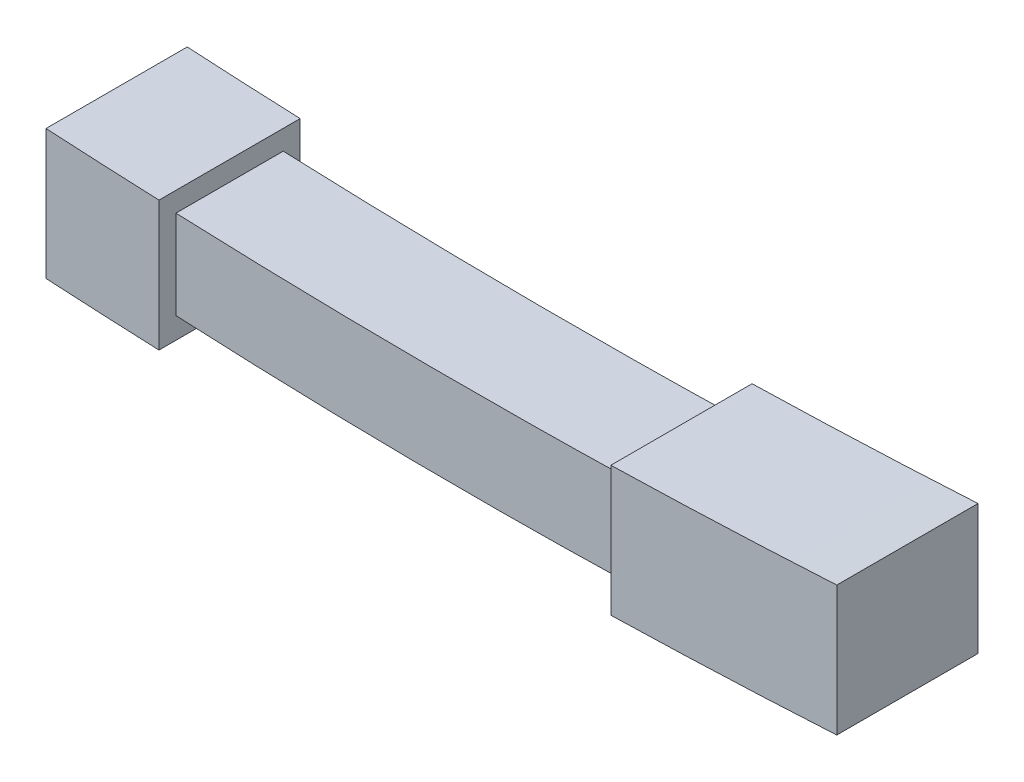
ISO-10303-21;
HEADER;
FILE_DESCRIPTION(('STEP AP214'),'2;1');
FILE_NAME('part.step','',(''),(''),'','','');
FILE_SCHEMA(('AUTOMOTIVE_DESIGN { 1 0 10303 214 1 1 1 1 }'));
ENDSEC;
DATA;
#1=APPLICATION_CONTEXT('core data for automotive mechanical design processes');
#2=APPLICATION_PROTOCOL_DEFINITION('international standard','automotive_design',2000,#1);
#3=PRODUCT_CONTEXT('',#1,'mechanical');
#4=PRODUCT('Part','Part','',(#3));
#5=PRODUCT_RELATED_PRODUCT_CATEGORY('part','',(#4));
#6=PRODUCT_DEFINITION_FORMATION('','',#4);
#7=PRODUCT_DEFINITION_CONTEXT('part definition',#1,'design');
#8=PRODUCT_DEFINITION('design','',#6,#7);
#9=PRODUCT_DEFINITION_SHAPE('','',#8);
#10=(LENGTH_UNIT() NAMED_UNIT(*) SI_UNIT(.MILLI.,.METRE.));
#11=(NAMED_UNIT(*) PLANE_ANGLE_UNIT() SI_UNIT($,.RADIAN.));
#12=(NAMED_UNIT(*) SI_UNIT($,.STERADIAN.) SOLID_ANGLE_UNIT());
#13=UNCERTAINTY_MEASURE_WITH_UNIT(LENGTH_MEASURE(1.E-05),#10,'distance_accuracy_value','');
#14=(GEOMETRIC_REPRESENTATION_CONTEXT(3) GLOBAL_UNCERTAINTY_ASSIGNED_CONTEXT((#13)) GLOBAL_UNIT_ASSIGNED_CONTEXT((#10,
#11,#12)) REPRESENTATION_CONTEXT('',''));
#15=CARTESIAN_POINT('',(0.,0.,0.));
#16=DIRECTION('',(0.,0.,1.));
#17=DIRECTION('',(1.,0.,0.));
#18=AXIS2_PLACEMENT_3D('',#15,#16,#17);
#19=CARTESIAN_POINT('',(-50.,20.5204081632653,-12.5));
#20=CARTESIAN_POINT('',(-10.0053296914234,18.8877550966062,-12.5));
#21=CARTESIAN_POINT('',(30.,19.8673469387755,-12.5));
#22=B_SPLINE_CURVE_WITH_KNOTS('',2,(#19,#20,#21),.UNSPECIFIED.,.F.,.F.,(3,3),(0.,1.),.UNSPECIFIED.);
#23=DIRECTION('',(0.,0.,1.));
#24=VECTOR('',#23,1.);
#25=SURFACE_OF_LINEAR_EXTRUSION('',#22,#24);
#26=CARTESIAN_POINT('',(-50.,20.5204081632653,-9.50000000000003));
#27=CARTESIAN_POINT('',(-10.0053296914234,18.8877550966062,-9.50000000000003));
#28=CARTESIAN_POINT('',(30.,19.8673469387755,-9.50000000000003));
#29=B_SPLINE_CURVE_WITH_KNOTS('',2,(#26,#27,#28),.UNSPECIFIED.,.F.,.F.,(3,3),(0.,1.),.UNSPECIFIED.);
#30=CARTESIAN_POINT('',(-50.,20.5204081632653,-9.50000000000002));
#31=VERTEX_POINT('',#30);
#32=CARTESIAN_POINT('',(30.,19.8673469387755,-9.50000000000004));
#33=VERTEX_POINT('',#32);
#34=EDGE_CURVE('E127',#31,#33,#29,.T.);
#35=ORIENTED_EDGE('',*,*,#34,.F.);
#36=DIRECTION('',(0.,0.,1.));
#37=VECTOR('',#36,1.);
#38=CARTESIAN_POINT('',(-50.,20.5204081632653,-12.5));
#39=LINE('',#38,#37);
#40=CARTESIAN_POINT('',(-50.,20.5204081632653,9.50000000000001));
#41=VERTEX_POINT('',#40);
#42=EDGE_CURVE('E152',#31,#41,#39,.T.);
#43=ORIENTED_EDGE('',*,*,#42,.T.);
#44=CARTESIAN_POINT('',(-50.,20.5204081632653,9.5));
#45=CARTESIAN_POINT('',(-10.0053296914234,18.8877550966062,9.5));
#46=CARTESIAN_POINT('',(30.,19.8673469387755,9.5));
#47=B_SPLINE_CURVE_WITH_KNOTS('',2,(#44,#45,#46),.UNSPECIFIED.,.F.,.F.,(3,3),(0.,1.),.UNSPECIFIED.);
#48=CARTESIAN_POINT('',(30.,19.8673469387755,9.50000000000001));
#49=VERTEX_POINT('',#48);
#50=EDGE_CURVE('E150',#49,#41,#47,.F.);
#51=ORIENTED_EDGE('',*,*,#50,.F.);
#52=DIRECTION('',(0.,0.,1.));
#53=VECTOR('',#52,1.);
#54=CARTESIAN_POINT('',(30.,19.8673469387755,-12.5));
#55=LINE('',#54,#53);
#56=EDGE_CURVE('E144',#33,#49,#55,.T.);
#57=ORIENTED_EDGE('',*,*,#56,.F.);
#58=EDGE_LOOP('',(#35,#43,#51,#57));
#59=FACE_BOUND('',#58,.T.);
#60=ADVANCED_FACE('F35',(#59),#25,.F.);
#61=CARTESIAN_POINT('',(-50.,4.81303337381789,-12.5));
#62=CARTESIAN_POINT('',(-10.0107895376873,2.79999119229216,-12.5));
#63=CARTESIAN_POINT('',(30.,3.86734693877551,-12.5));
#64=B_SPLINE_CURVE_WITH_KNOTS('',2,(#61,#62,#63),.UNSPECIFIED.,.F.,.F.,(3,3),(0.,1.),.UNSPECIFIED.);
#65=DIRECTION('',(0.,0.,1.));
#66=VECTOR('',#65,1.);
#67=SURFACE_OF_LINEAR_EXTRUSION('',#64,#66);
#68=DIRECTION('',(0.,0.,1.));
#69=VECTOR('',#68,1.);
#70=CARTESIAN_POINT('',(-50.,4.81303337381789,-12.5));
#71=LINE('',#70,#69);
#72=CARTESIAN_POINT('',(-50.,4.81303337381789,-9.50000000000002));
#73=VERTEX_POINT('',#72);
#74=CARTESIAN_POINT('',(-50.,4.81303337381789,9.5));
#75=VERTEX_POINT('',#74);
#76=EDGE_CURVE('E50',#73,#75,#71,.T.);
#77=ORIENTED_EDGE('',*,*,#76,.F.);
#78=CARTESIAN_POINT('',(-50.,4.81303337381789,-9.50000000000003));
#79=CARTESIAN_POINT('',(-10.0107895376873,2.79999119229216,-9.50000000000003));
#80=CARTESIAN_POINT('',(30.,3.86734693877551,-9.50000000000003));
#81=B_SPLINE_CURVE_WITH_KNOTS('',2,(#78,#79,#80),.UNSPECIFIED.,.F.,.F.,(3,3),(0.,1.),.UNSPECIFIED.);
#82=CARTESIAN_POINT('',(30.,3.86734693877552,-9.50000000000004));
#83=VERTEX_POINT('',#82);
#84=EDGE_CURVE('E137',#73,#83,#81,.T.);
#85=ORIENTED_EDGE('',*,*,#84,.T.);
#86=DIRECTION('',(0.,0.,1.));
#87=VECTOR('',#86,1.);
#88=CARTESIAN_POINT('',(30.,3.86734693877551,-12.5));
#89=LINE('',#88,#87);
#90=CARTESIAN_POINT('',(30.,3.86734693877551,9.50000000000001));
#91=VERTEX_POINT('',#90);
#92=EDGE_CURVE('E146',#83,#91,#89,.T.);
#93=ORIENTED_EDGE('',*,*,#92,.T.);
#94=CARTESIAN_POINT('',(-50.,4.81303337381789,9.5));
#95=CARTESIAN_POINT('',(-10.0107895376873,2.79999119229216,9.5));
#96=CARTESIAN_POINT('',(30.,3.86734693877551,9.5));
#97=B_SPLINE_CURVE_WITH_KNOTS('',2,(#94,#95,#96),.UNSPECIFIED.,.F.,.F.,(3,3),(0.,1.),.UNSPECIFIED.);
#98=EDGE_CURVE('E496',#91,#75,#97,.F.);
#99=ORIENTED_EDGE('',*,*,#98,.T.);
#100=EDGE_LOOP('',(#77,#85,#93,#99));
#101=FACE_BOUND('',#100,.T.);
#102=ADVANCED_FACE('F251',(#101),#67,.T.);
#103=CARTESIAN_POINT('',(70.,25.,-12.5));
#104=DIRECTION('',(0.,0.,1.));
#105=DIRECTION('',(1.,0.,0.));
#106=AXIS2_PLACEMENT_3D('',#103,#104,#105);
#107=PLANE('',#106);
#108=CARTESIAN_POINT('',(-70.,2.,-12.5));
#109=CARTESIAN_POINT('',(0.,-2.,-12.5));
#110=CARTESIAN_POINT('',(70.,2.,-12.5));
#111=B_SPLINE_CURVE_WITH_KNOTS('',2,(#108,#109,#110),.UNSPECIFIED.,.F.,.F.,(3,3),(0.,1.),.UNSPECIFIED.);
#112=CARTESIAN_POINT('',(30.,0.36734693877551,-12.5));
#113=VERTEX_POINT('',#112);
#114=CARTESIAN_POINT('',(70.,2.,-12.5));
#115=VERTEX_POINT('',#114);
#116=EDGE_CURVE('E194',#113,#115,#111,.T.);
#117=ORIENTED_EDGE('',*,*,#116,.F.);
#118=DIRECTION('',(0.,-1.,0.));
#119=VECTOR('',#118,1.);
#120=CARTESIAN_POINT('',(30.,0.,-12.5));
#121=LINE('',#120,#119);
#122=CARTESIAN_POINT('',(30.,23.3673469387755,-12.5));
#123=VERTEX_POINT('',#122);
#124=EDGE_CURVE('E266',#123,#113,#121,.T.);
#125=ORIENTED_EDGE('',*,*,#124,.F.);
#126=CARTESIAN_POINT('',(-70.,25.,-12.5));
#127=CARTESIAN_POINT('',(0.,21.,-12.5));
#128=CARTESIAN_POINT('',(70.,25.,-12.5));
#129=B_SPLINE_CURVE_WITH_KNOTS('',2,(#126,#127,#128),.UNSPECIFIED.,.F.,.F.,(3,3),(0.,1.),.UNSPECIFIED.);
#130=CARTESIAN_POINT('',(70.,25.,-12.5));
#131=VERTEX_POINT('',#130);
#132=EDGE_CURVE('E161',#123,#131,#129,.T.);
#133=ORIENTED_EDGE('',*,*,#132,.T.);
#134=DIRECTION('',(0.,-1.,0.));
#135=VECTOR('',#134,1.);
#136=CARTESIAN_POINT('',(70.,25.,-12.5));
#137=LINE('',#136,#135);
#138=EDGE_CURVE('E168',#131,#115,#137,.T.);
#139=ORIENTED_EDGE('',*,*,#138,.T.);
#140=EDGE_LOOP('',(#117,#125,#133,#139));
#141=FACE_BOUND('',#140,.T.);
#142=ADVANCED_FACE('F241',(#141),#107,.F.);
#143=CARTESIAN_POINT('',(70.,25.,12.5));
#144=DIRECTION('',(0.,0.,-1.));
#145=DIRECTION('',(-1.,0.,0.));
#146=AXIS2_PLACEMENT_3D('',#143,#144,#145);
#147=PLANE('',#146);
#148=CARTESIAN_POINT('',(-70.,2.,12.5));
#149=CARTESIAN_POINT('',(0.,-2.,12.5));
#150=CARTESIAN_POINT('',(70.,2.,12.5));
#151=B_SPLINE_CURVE_WITH_KNOTS('',2,(#148,#149,#150),.UNSPECIFIED.,.F.,.F.,(3,3),(0.,1.),.UNSPECIFIED.);
#152=CARTESIAN_POINT('',(-70.,2.,12.5));
#153=VERTEX_POINT('',#152);
#154=CARTESIAN_POINT('',(-50.,1.02040816326531,12.5));
#155=VERTEX_POINT('',#154);
#156=EDGE_CURVE('E191',#153,#155,#151,.T.);
#157=ORIENTED_EDGE('',*,*,#156,.T.);
#158=DIRECTION('',(0.,-1.,0.));
#159=VECTOR('',#158,1.);
#160=CARTESIAN_POINT('',(-50.,0.,12.5));
#161=LINE('',#160,#159);
#162=CARTESIAN_POINT('',(-50.,24.0204081632653,12.5));
#163=VERTEX_POINT('',#162);
#164=EDGE_CURVE('E482',#163,#155,#161,.T.);
#165=ORIENTED_EDGE('',*,*,#164,.F.);
#166=CARTESIAN_POINT('',(-70.,25.,12.5));
#167=CARTESIAN_POINT('',(0.,21.,12.5));
#168=CARTESIAN_POINT('',(70.,25.,12.5));
#169=B_SPLINE_CURVE_WITH_KNOTS('',2,(#166,#167,#168),.UNSPECIFIED.,.F.,.F.,(3,3),(0.,1.),.UNSPECIFIED.);
#170=CARTESIAN_POINT('',(-70.,25.,12.5));
#171=VERTEX_POINT('',#170);
#172=EDGE_CURVE('E208',#171,#163,#169,.T.);
#173=ORIENTED_EDGE('',*,*,#172,.F.);
#174=DIRECTION('',(0.,-1.,0.));
#175=VECTOR('',#174,1.);
#176=CARTESIAN_POINT('',(-70.,25.,12.5));
#177=LINE('',#176,#175);
#178=EDGE_CURVE('E11',#171,#153,#177,.T.);
#179=ORIENTED_EDGE('',*,*,#178,.T.);
#180=EDGE_LOOP('',(#157,#165,#173,#179));
#181=FACE_BOUND('',#180,.T.);
#182=ADVANCED_FACE('F243',(#181),#147,.F.);
#183=DIRECTION('',(0.,-1.,0.));
#184=VECTOR('',#183,1.);
#185=CARTESIAN_POINT('',(30.,0.,12.5));
#186=LINE('',#185,#184);
#187=CARTESIAN_POINT('',(30.,23.3673469387755,12.5));
#188=VERTEX_POINT('',#187);
#189=CARTESIAN_POINT('',(30.,0.36734693877551,12.5));
#190=VERTEX_POINT('',#189);
#191=EDGE_CURVE('E186',#188,#190,#186,.T.);
#192=ORIENTED_EDGE('',*,*,#191,.T.);
#193=CARTESIAN_POINT('',(-70.,2.,12.5));
#194=CARTESIAN_POINT('',(0.,-2.,12.5));
#195=CARTESIAN_POINT('',(70.,2.,12.5));
#196=B_SPLINE_CURVE_WITH_KNOTS('',2,(#193,#194,#195),.UNSPECIFIED.,.F.,.F.,(3,3),(0.,1.),.UNSPECIFIED.);
#197=CARTESIAN_POINT('',(70.,2.,12.5));
#198=VERTEX_POINT('',#197);
#199=EDGE_CURVE('E184',#190,#198,#196,.T.);
#200=ORIENTED_EDGE('',*,*,#199,.T.);
#201=DIRECTION('',(0.,-1.,0.));
#202=VECTOR('',#201,1.);
#203=CARTESIAN_POINT('',(70.,25.,12.5));
#204=LINE('',#203,#202);
#205=CARTESIAN_POINT('',(70.,25.,12.5));
#206=VERTEX_POINT('',#205);
#207=EDGE_CURVE('E43',#206,#198,#204,.T.);
#208=ORIENTED_EDGE('',*,*,#207,.F.);
#209=CARTESIAN_POINT('',(-70.,25.,12.5));
#210=CARTESIAN_POINT('',(0.,21.,12.5));
#211=CARTESIAN_POINT('',(70.,25.,12.5));
#212=B_SPLINE_CURVE_WITH_KNOTS('',2,(#209,#210,#211),.UNSPECIFIED.,.F.,.F.,(3,3),(0.,1.),.UNSPECIFIED.);
#213=EDGE_CURVE('E182',#188,#206,#212,.T.);
#214=ORIENTED_EDGE('',*,*,#213,.F.);
#215=EDGE_LOOP('',(#192,#200,#208,#214));
#216=FACE_BOUND('',#215,.T.);
#217=ADVANCED_FACE('F181',(#216),#147,.F.);
#218=CARTESIAN_POINT('',(-70.,25.,12.5));
#219=DIRECTION('',(1.,0.,0.));
#220=DIRECTION('',(0.,0.,-1.));
#221=AXIS2_PLACEMENT_3D('',#218,#219,#220);
#222=PLANE('',#221);
#223=DIRECTION('',(0.,0.,1.));
#224=VECTOR('',#223,1.);
#225=CARTESIAN_POINT('',(-70.,2.,-12.5));
#226=LINE('',#225,#224);
#227=CARTESIAN_POINT('',(-70.,2.,-12.5));
#228=VERTEX_POINT('',#227);
#229=EDGE_CURVE('E212',#228,#153,#226,.T.);
#230=ORIENTED_EDGE('',*,*,#229,.T.);
#231=ORIENTED_EDGE('',*,*,#178,.F.);
#232=DIRECTION('',(0.,0.,1.));
#233=VECTOR('',#232,1.);
#234=CARTESIAN_POINT('',(-70.,25.,12.5));
#235=LINE('',#234,#233);
#236=CARTESIAN_POINT('',(-70.,25.,-12.5));
#237=VERTEX_POINT('',#236);
#238=EDGE_CURVE('E154',#237,#171,#235,.T.);
#239=ORIENTED_EDGE('',*,*,#238,.F.);
#240=DIRECTION('',(0.,-1.,0.));
#241=VECTOR('',#240,1.);
#242=CARTESIAN_POINT('',(-70.,25.,-12.5));
#243=LINE('',#242,#241);
#244=EDGE_CURVE('E165',#237,#228,#243,.T.);
#245=ORIENTED_EDGE('',*,*,#244,.T.);
#246=EDGE_LOOP('',(#230,#231,#239,#245));
#247=FACE_BOUND('',#246,.T.);
#248=ADVANCED_FACE('F37',(#247),#222,.F.);
#249=CARTESIAN_POINT('',(70.,25.,12.5));
#250=DIRECTION('',(-1.,0.,0.));
#251=DIRECTION('',(0.,0.,1.));
#252=AXIS2_PLACEMENT_3D('',#249,#250,#251);
#253=PLANE('',#252);
#254=DIRECTION('',(0.,0.,1.));
#255=VECTOR('',#254,1.);
#256=CARTESIAN_POINT('',(70.,2.,-12.5));
#257=LINE('',#256,#255);
#258=EDGE_CURVE('E177',#115,#198,#257,.T.);
#259=ORIENTED_EDGE('',*,*,#258,.F.);
#260=ORIENTED_EDGE('',*,*,#138,.F.);
#261=DIRECTION('',(0.,0.,-1.));
#262=VECTOR('',#261,1.);
#263=CARTESIAN_POINT('',(70.,25.,12.5));
#264=LINE('',#263,#262);
#265=EDGE_CURVE('E163',#206,#131,#264,.T.);
#266=ORIENTED_EDGE('',*,*,#265,.F.);
#267=ORIENTED_EDGE('',*,*,#207,.T.);
#268=EDGE_LOOP('',(#259,#260,#266,#267));
#269=FACE_BOUND('',#268,.T.);
#270=ADVANCED_FACE('F175',(#269),#253,.F.);
#271=DIRECTION('',(0.,-1.,0.));
#272=VECTOR('',#271,1.);
#273=CARTESIAN_POINT('',(-50.,0.,-12.5));
#274=LINE('',#273,#272);
#275=CARTESIAN_POINT('',(-50.,24.0204081632653,-12.5));
#276=VERTEX_POINT('',#275);
#277=CARTESIAN_POINT('',(-50.,1.0204081632653,-12.5));
#278=VERTEX_POINT('',#277);
#279=EDGE_CURVE('E58',#276,#278,#274,.T.);
#280=ORIENTED_EDGE('',*,*,#279,.T.);
#281=CARTESIAN_POINT('',(-70.,2.,-12.5));
#282=CARTESIAN_POINT('',(0.,-2.,-12.5));
#283=CARTESIAN_POINT('',(70.,2.,-12.5));
#284=B_SPLINE_CURVE_WITH_KNOTS('',2,(#281,#282,#283),.UNSPECIFIED.,.F.,.F.,(3,3),(0.,1.),.UNSPECIFIED.);
#285=EDGE_CURVE('E190',#228,#278,#284,.T.);
#286=ORIENTED_EDGE('',*,*,#285,.F.);
#287=ORIENTED_EDGE('',*,*,#244,.F.);
#288=CARTESIAN_POINT('',(-70.,25.,-12.5));
#289=CARTESIAN_POINT('',(0.,21.,-12.5));
#290=CARTESIAN_POINT('',(70.,25.,-12.5));
#291=B_SPLINE_CURVE_WITH_KNOTS('',2,(#288,#289,#290),.UNSPECIFIED.,.F.,.F.,(3,3),(0.,1.),.UNSPECIFIED.);
#292=EDGE_CURVE('E219',#237,#276,#291,.T.);
#293=ORIENTED_EDGE('',*,*,#292,.T.);
#294=EDGE_LOOP('',(#280,#286,#287,#293));
#295=FACE_BOUND('',#294,.T.);
#296=ADVANCED_FACE('F237',(#295),#107,.F.);
#297=DIRECTION('',(0.,0.,1.));
#298=VECTOR('',#297,1.);
#299=SURFACE_OF_LINEAR_EXTRUSION('',#129,#298);
#300=ORIENTED_EDGE('',*,*,#213,.T.);
#301=ORIENTED_EDGE('',*,*,#265,.T.);
#302=ORIENTED_EDGE('',*,*,#132,.F.);
#303=DIRECTION('',(0.,0.,1.));
#304=VECTOR('',#303,1.);
#305=CARTESIAN_POINT('',(30.,23.3673469387755,-12.5));
#306=LINE('',#305,#304);
#307=EDGE_CURVE('E151',#123,#188,#306,.T.);
#308=ORIENTED_EDGE('',*,*,#307,.T.);
#309=EDGE_LOOP('',(#300,#301,#302,#308));
#310=FACE_BOUND('',#309,.T.);
#311=ADVANCED_FACE('F240',(#310),#299,.F.);
#312=CARTESIAN_POINT('',(30.,0.,-12.5));
#313=DIRECTION('',(-1.,0.,0.));
#314=DIRECTION('',(0.,-1.,0.));
#315=AXIS2_PLACEMENT_3D('',#312,#313,#314);
#316=PLANE('',#315);
#317=DIRECTION('',(0.,-1.,0.));
#318=VECTOR('',#317,1.);
#319=CARTESIAN_POINT('',(30.,21.6173469387755,-9.50000000000004));
#320=LINE('',#319,#318);
#321=EDGE_CURVE('E130',#33,#83,#320,.T.);
#322=ORIENTED_EDGE('',*,*,#321,.F.);
#323=ORIENTED_EDGE('',*,*,#56,.T.);
#324=DIRECTION('',(0.,-1.,0.));
#325=VECTOR('',#324,1.);
#326=CARTESIAN_POINT('',(30.,0.,9.50000000000001));
#327=LINE('',#326,#325);
#328=EDGE_CURVE('E136',#49,#91,#327,.T.);
#329=ORIENTED_EDGE('',*,*,#328,.T.);
#330=ORIENTED_EDGE('',*,*,#92,.F.);
#331=EDGE_LOOP('',(#322,#323,#329,#330));
#332=FACE_BOUND('',#331,.T.);
#333=ORIENTED_EDGE('',*,*,#124,.T.);
#334=DIRECTION('',(0.,0.,1.));
#335=VECTOR('',#334,1.);
#336=CARTESIAN_POINT('',(30.,0.36734693877551,-12.5));
#337=LINE('',#336,#335);
#338=EDGE_CURVE('E209',#113,#190,#337,.T.);
#339=ORIENTED_EDGE('',*,*,#338,.T.);
#340=ORIENTED_EDGE('',*,*,#191,.F.);
#341=ORIENTED_EDGE('',*,*,#307,.F.);
#342=EDGE_LOOP('',(#333,#339,#340,#341));
#343=FACE_BOUND('',#342,.T.);
#344=ADVANCED_FACE('F141',(#332,#343),#316,.T.);
#345=CARTESIAN_POINT('',(-50.,0.,-12.5));
#346=DIRECTION('',(-1.,0.,0.));
#347=DIRECTION('',(0.,0.,1.));
#348=AXIS2_PLACEMENT_3D('',#345,#346,#347);
#349=PLANE('',#348);
#350=ORIENTED_EDGE('',*,*,#42,.F.);
#351=DIRECTION('',(0.,1.,0.));
#352=VECTOR('',#351,1.);
#353=CARTESIAN_POINT('',(-50.,21.6173469387755,-9.50000000000002));
#354=LINE('',#353,#352);
#355=EDGE_CURVE('E132',#73,#31,#354,.T.);
#356=ORIENTED_EDGE('',*,*,#355,.F.);
#357=ORIENTED_EDGE('',*,*,#76,.T.);
#358=DIRECTION('',(0.,1.,0.));
#359=VECTOR('',#358,1.);
#360=CARTESIAN_POINT('',(-50.,0.,9.50000000000001));
#361=LINE('',#360,#359);
#362=EDGE_CURVE('E493',#75,#41,#361,.T.);
#363=ORIENTED_EDGE('',*,*,#362,.T.);
#364=EDGE_LOOP('',(#350,#356,#357,#363));
#365=FACE_BOUND('',#364,.T.);
#366=DIRECTION('',(0.,0.,1.));
#367=VECTOR('',#366,1.);
#368=CARTESIAN_POINT('',(-50.,1.02040816326531,-12.5));
#369=LINE('',#368,#367);
#370=EDGE_CURVE('E215',#278,#155,#369,.T.);
#371=ORIENTED_EDGE('',*,*,#370,.F.);
#372=ORIENTED_EDGE('',*,*,#279,.F.);
#373=DIRECTION('',(0.,0.,1.));
#374=VECTOR('',#373,1.);
#375=CARTESIAN_POINT('',(-50.,24.0204081632653,-12.5));
#376=LINE('',#375,#374);
#377=EDGE_CURVE('E156',#276,#163,#376,.T.);
#378=ORIENTED_EDGE('',*,*,#377,.T.);
#379=ORIENTED_EDGE('',*,*,#164,.T.);
#380=EDGE_LOOP('',(#371,#372,#378,#379));
#381=FACE_BOUND('',#380,.T.);
#382=ADVANCED_FACE('F234',(#365,#381),#349,.F.);
#383=DIRECTION('',(0.,0.,1.));
#384=VECTOR('',#383,1.);
#385=SURFACE_OF_LINEAR_EXTRUSION('',#291,#384);
#386=ORIENTED_EDGE('',*,*,#172,.T.);
#387=ORIENTED_EDGE('',*,*,#377,.F.);
#388=ORIENTED_EDGE('',*,*,#292,.F.);
#389=ORIENTED_EDGE('',*,*,#238,.T.);
#390=EDGE_LOOP('',(#386,#387,#388,#389));
#391=FACE_BOUND('',#390,.T.);
#392=ADVANCED_FACE('F229',(#391),#385,.F.);
#393=DIRECTION('',(0.,0.,1.));
#394=VECTOR('',#393,1.);
#395=SURFACE_OF_LINEAR_EXTRUSION('',#111,#394);
#396=ORIENTED_EDGE('',*,*,#199,.F.);
#397=ORIENTED_EDGE('',*,*,#338,.F.);
#398=ORIENTED_EDGE('',*,*,#116,.T.);
#399=ORIENTED_EDGE('',*,*,#258,.T.);
#400=EDGE_LOOP('',(#396,#397,#398,#399));
#401=FACE_BOUND('',#400,.T.);
#402=ADVANCED_FACE('F233',(#401),#395,.T.);
#403=DIRECTION('',(0.,0.,1.));
#404=VECTOR('',#403,1.);
#405=SURFACE_OF_LINEAR_EXTRUSION('',#284,#404);
#406=ORIENTED_EDGE('',*,*,#156,.F.);
#407=ORIENTED_EDGE('',*,*,#229,.F.);
#408=ORIENTED_EDGE('',*,*,#285,.T.);
#409=ORIENTED_EDGE('',*,*,#370,.T.);
#410=EDGE_LOOP('',(#406,#407,#408,#409));
#411=FACE_BOUND('',#410,.T.);
#412=ADVANCED_FACE('F286',(#411),#405,.T.);
#413=CARTESIAN_POINT('',(0.,0.,9.50000000000001));
#414=DIRECTION('',(0.,0.,1.));
#415=DIRECTION('',(1.,0.,0.));
#416=AXIS2_PLACEMENT_3D('',#413,#414,#415);
#417=PLANE('',#416);
#418=ORIENTED_EDGE('',*,*,#50,.T.);
#419=ORIENTED_EDGE('',*,*,#362,.F.);
#420=ORIENTED_EDGE('',*,*,#98,.F.);
#421=ORIENTED_EDGE('',*,*,#328,.F.);
#422=EDGE_LOOP('',(#418,#419,#420,#421));
#423=FACE_BOUND('',#422,.T.);
#424=ADVANCED_FACE('F312',(#423),#417,.T.);
#425=CARTESIAN_POINT('',(0.,0.,-9.50000000000003));
#426=DIRECTION('',(0.,0.,-1.));
#427=DIRECTION('',(-1.,0.,0.));
#428=AXIS2_PLACEMENT_3D('',#425,#426,#427);
#429=PLANE('',#428);
#430=ORIENTED_EDGE('',*,*,#34,.T.);
#431=ORIENTED_EDGE('',*,*,#321,.T.);
#432=ORIENTED_EDGE('',*,*,#84,.F.);
#433=ORIENTED_EDGE('',*,*,#355,.T.);
#434=EDGE_LOOP('',(#430,#431,#432,#433));
#435=FACE_BOUND('',#434,.T.);
#436=ADVANCED_FACE('F129',(#435),#429,.T.);
#437=CLOSED_SHELL('',(#60,#102,#142,#182,#217,#248,#270,#296,#311,#344,#382,#392,#402,#412,#424,#436));
#438=MANIFOLD_SOLID_BREP('B2',#437);
#439=ADVANCED_BREP_SHAPE_REPRESENTATION('',(#18,#438),#14);
#440=SHAPE_DEFINITION_REPRESENTATION(#9,#439);
ENDSEC;
END-ISO-10303-21;
